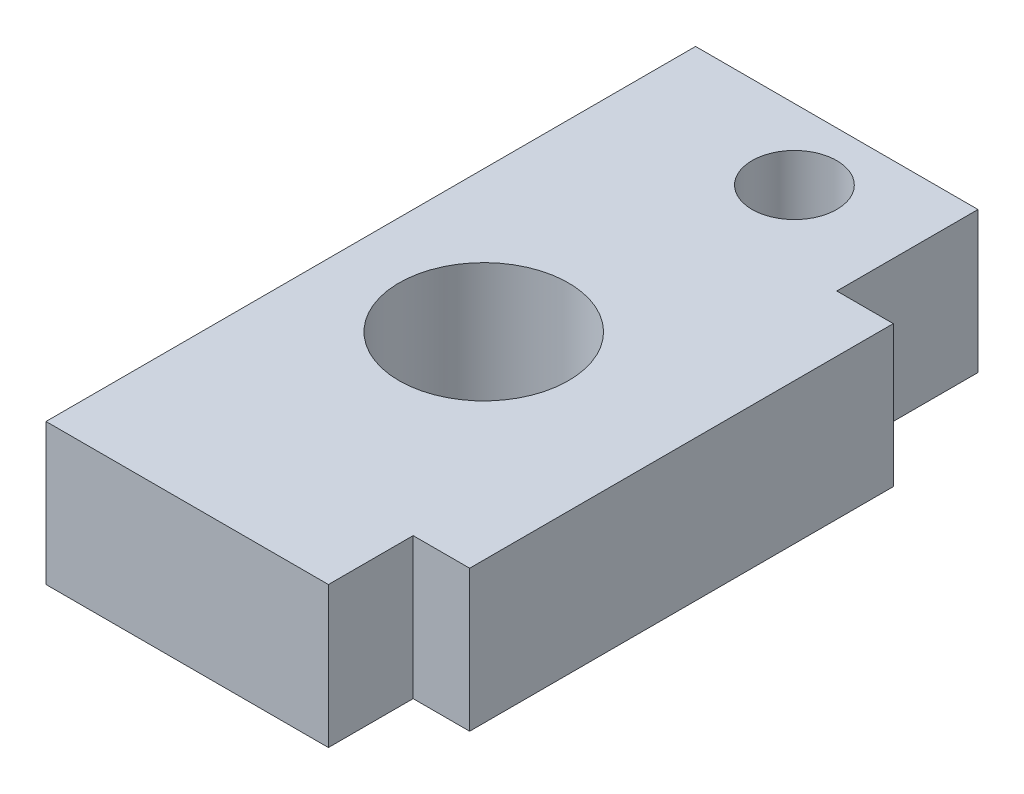
ISO-10303-21;
HEADER;
FILE_DESCRIPTION(('STEP AP214'),'2;1');
FILE_NAME('part.step','',(''),(''),'','','');
FILE_SCHEMA(('AUTOMOTIVE_DESIGN { 1 0 10303 214 1 1 1 1 }'));
ENDSEC;
DATA;
#1=APPLICATION_CONTEXT('core data for automotive mechanical design processes');
#2=APPLICATION_PROTOCOL_DEFINITION('international standard','automotive_design',2000,#1);
#3=PRODUCT_CONTEXT('',#1,'mechanical');
#4=PRODUCT('Part','Part','',(#3));
#5=PRODUCT_RELATED_PRODUCT_CATEGORY('part','',(#4));
#6=PRODUCT_DEFINITION_FORMATION('','',#4);
#7=PRODUCT_DEFINITION_CONTEXT('part definition',#1,'design');
#8=PRODUCT_DEFINITION('design','',#6,#7);
#9=PRODUCT_DEFINITION_SHAPE('','',#8);
#10=(LENGTH_UNIT() NAMED_UNIT(*) SI_UNIT(.MILLI.,.METRE.));
#11=(NAMED_UNIT(*) PLANE_ANGLE_UNIT() SI_UNIT($,.RADIAN.));
#12=(NAMED_UNIT(*) SI_UNIT($,.STERADIAN.) SOLID_ANGLE_UNIT());
#13=UNCERTAINTY_MEASURE_WITH_UNIT(LENGTH_MEASURE(1.E-05),#10,'distance_accuracy_value','');
#14=(GEOMETRIC_REPRESENTATION_CONTEXT(3) GLOBAL_UNCERTAINTY_ASSIGNED_CONTEXT((#13)) GLOBAL_UNIT_ASSIGNED_CONTEXT((#10,
#11,#12)) REPRESENTATION_CONTEXT('',''));
#15=CARTESIAN_POINT('',(0.,0.,0.));
#16=DIRECTION('',(0.,0.,1.));
#17=DIRECTION('',(1.,0.,0.));
#18=AXIS2_PLACEMENT_3D('',#15,#16,#17);
#19=CARTESIAN_POINT('',(-5.,5.,7.5));
#20=DIRECTION('',(0.,0.,-1.));
#21=DIRECTION('',(-1.,0.,0.));
#22=AXIS2_PLACEMENT_3D('',#19,#20,#21);
#23=PLANE('',#22);
#24=DIRECTION('',(0.,1.,0.));
#25=VECTOR('',#24,1.);
#26=CARTESIAN_POINT('',(5.,0.,7.5));
#27=LINE('',#26,#25);
#28=CARTESIAN_POINT('',(5.,0.,7.5));
#29=VERTEX_POINT('',#28);
#30=CARTESIAN_POINT('',(5.,5.,7.5));
#31=VERTEX_POINT('',#30);
#32=EDGE_CURVE('E51',#29,#31,#27,.T.);
#33=ORIENTED_EDGE('',*,*,#32,.F.);
#34=DIRECTION('',(1.,0.,0.));
#35=VECTOR('',#34,1.);
#36=CARTESIAN_POINT('',(-5.,0.,7.5));
#37=LINE('',#36,#35);
#38=CARTESIAN_POINT('',(7.,0.,7.5));
#39=VERTEX_POINT('',#38);
#40=EDGE_CURVE('E154',#29,#39,#37,.T.);
#41=ORIENTED_EDGE('',*,*,#40,.T.);
#42=DIRECTION('',(0.,-1.,0.));
#43=VECTOR('',#42,1.);
#44=CARTESIAN_POINT('',(7.,5.,7.5));
#45=LINE('',#44,#43);
#46=CARTESIAN_POINT('',(7.,5.,7.5));
#47=VERTEX_POINT('',#46);
#48=EDGE_CURVE('E11',#47,#39,#45,.T.);
#49=ORIENTED_EDGE('',*,*,#48,.F.);
#50=DIRECTION('',(1.,0.,0.));
#51=VECTOR('',#50,1.);
#52=CARTESIAN_POINT('',(-5.,5.,7.5));
#53=LINE('',#52,#51);
#54=EDGE_CURVE('E99',#31,#47,#53,.T.);
#55=ORIENTED_EDGE('',*,*,#54,.F.);
#56=EDGE_LOOP('',(#33,#41,#49,#55));
#57=FACE_BOUND('',#56,.T.);
#58=ADVANCED_FACE('F34',(#57),#23,.F.);
#59=CARTESIAN_POINT('',(-5.,5.,-7.5));
#60=DIRECTION('',(1.,0.,0.));
#61=DIRECTION('',(0.,0.,-1.));
#62=AXIS2_PLACEMENT_3D('',#59,#60,#61);
#63=PLANE('',#62);
#64=DIRECTION('',(0.,0.,1.));
#65=VECTOR('',#64,1.);
#66=CARTESIAN_POINT('',(-5.,0.,-7.5));
#67=LINE('',#66,#65);
#68=CARTESIAN_POINT('',(-5.,0.,-12.5));
#69=VERTEX_POINT('',#68);
#70=CARTESIAN_POINT('',(-5.,0.,10.5));
#71=VERTEX_POINT('',#70);
#72=EDGE_CURVE('E157',#69,#71,#67,.T.);
#73=ORIENTED_EDGE('',*,*,#72,.T.);
#74=DIRECTION('',(0.,1.,0.));
#75=VECTOR('',#74,1.);
#76=CARTESIAN_POINT('',(-5.,0.,10.5));
#77=LINE('',#76,#75);
#78=CARTESIAN_POINT('',(-5.,5.,10.5));
#79=VERTEX_POINT('',#78);
#80=EDGE_CURVE('E115',#71,#79,#77,.T.);
#81=ORIENTED_EDGE('',*,*,#80,.T.);
#82=DIRECTION('',(0.,0.,1.));
#83=VECTOR('',#82,1.);
#84=CARTESIAN_POINT('',(-5.,5.,-7.5));
#85=LINE('',#84,#83);
#86=CARTESIAN_POINT('',(-5.,5.,-12.5));
#87=VERTEX_POINT('',#86);
#88=EDGE_CURVE('E104',#87,#79,#85,.T.);
#89=ORIENTED_EDGE('',*,*,#88,.F.);
#90=DIRECTION('',(0.,1.,0.));
#91=VECTOR('',#90,1.);
#92=CARTESIAN_POINT('',(-5.,0.,-12.5));
#93=LINE('',#92,#91);
#94=EDGE_CURVE('E176',#69,#87,#93,.T.);
#95=ORIENTED_EDGE('',*,*,#94,.F.);
#96=EDGE_LOOP('',(#73,#81,#89,#95));
#97=FACE_BOUND('',#96,.T.);
#98=ADVANCED_FACE('F36',(#97),#63,.F.);
#99=CARTESIAN_POINT('',(7.,5.,-7.5));
#100=DIRECTION('',(-1.,0.,0.));
#101=DIRECTION('',(0.,0.,1.));
#102=AXIS2_PLACEMENT_3D('',#99,#100,#101);
#103=PLANE('',#102);
#104=DIRECTION('',(0.,0.,-1.));
#105=VECTOR('',#104,1.);
#106=CARTESIAN_POINT('',(7.,0.,-7.5));
#107=LINE('',#106,#105);
#108=CARTESIAN_POINT('',(7.,0.,-7.5));
#109=VERTEX_POINT('',#108);
#110=EDGE_CURVE('E156',#39,#109,#107,.T.);
#111=ORIENTED_EDGE('',*,*,#110,.T.);
#112=DIRECTION('',(0.,-1.,0.));
#113=VECTOR('',#112,1.);
#114=CARTESIAN_POINT('',(7.,5.,-7.5));
#115=LINE('',#114,#113);
#116=CARTESIAN_POINT('',(7.,5.,-7.5));
#117=VERTEX_POINT('',#116);
#118=EDGE_CURVE('E43',#117,#109,#115,.T.);
#119=ORIENTED_EDGE('',*,*,#118,.F.);
#120=DIRECTION('',(0.,0.,-1.));
#121=VECTOR('',#120,1.);
#122=CARTESIAN_POINT('',(7.,5.,-7.5));
#123=LINE('',#122,#121);
#124=EDGE_CURVE('E103',#47,#117,#123,.T.);
#125=ORIENTED_EDGE('',*,*,#124,.F.);
#126=ORIENTED_EDGE('',*,*,#48,.T.);
#127=EDGE_LOOP('',(#111,#119,#125,#126));
#128=FACE_BOUND('',#127,.T.);
#129=ADVANCED_FACE('F230',(#128),#103,.F.);
#130=CARTESIAN_POINT('',(-5.,5.,-7.5));
#131=DIRECTION('',(0.,0.,1.));
#132=DIRECTION('',(1.,0.,0.));
#133=AXIS2_PLACEMENT_3D('',#130,#131,#132);
#134=PLANE('',#133);
#135=DIRECTION('',(-1.,0.,0.));
#136=VECTOR('',#135,1.);
#137=CARTESIAN_POINT('',(-5.,0.,-7.5));
#138=LINE('',#137,#136);
#139=CARTESIAN_POINT('',(5.,0.,-7.5));
#140=VERTEX_POINT('',#139);
#141=EDGE_CURVE('E164',#109,#140,#138,.T.);
#142=ORIENTED_EDGE('',*,*,#141,.T.);
#143=DIRECTION('',(0.,1.,0.));
#144=VECTOR('',#143,1.);
#145=CARTESIAN_POINT('',(5.,0.,-7.5));
#146=LINE('',#145,#144);
#147=CARTESIAN_POINT('',(5.,5.,-7.5));
#148=VERTEX_POINT('',#147);
#149=EDGE_CURVE('E145',#140,#148,#146,.T.);
#150=ORIENTED_EDGE('',*,*,#149,.T.);
#151=DIRECTION('',(-1.,0.,0.));
#152=VECTOR('',#151,1.);
#153=CARTESIAN_POINT('',(-5.,5.,-7.5));
#154=LINE('',#153,#152);
#155=EDGE_CURVE('E170',#117,#148,#154,.T.);
#156=ORIENTED_EDGE('',*,*,#155,.F.);
#157=ORIENTED_EDGE('',*,*,#118,.T.);
#158=EDGE_LOOP('',(#142,#150,#156,#157));
#159=FACE_BOUND('',#158,.T.);
#160=ADVANCED_FACE('F189',(#159),#134,.F.);
#161=CARTESIAN_POINT('',(0.,5.,0.));
#162=DIRECTION('',(0.,1.,0.));
#163=DIRECTION('',(0.,0.,1.));
#164=AXIS2_PLACEMENT_3D('',#161,#162,#163);
#165=PLANE('',#164);
#166=CARTESIAN_POINT('',(0.,5.,0.));
#167=DIRECTION('',(0.,1.,0.));
#168=DIRECTION('',(0.,0.,1.));
#169=AXIS2_PLACEMENT_3D('',#166,#167,#168);
#170=CIRCLE('',#169,3.);
#171=CARTESIAN_POINT('',(0.,5.,3.));
#172=VERTEX_POINT('',#171);
#173=EDGE_CURVE('E208',#172,#172,#170,.T.);
#174=ORIENTED_EDGE('',*,*,#173,.F.);
#175=EDGE_LOOP('',(#174));
#176=FACE_BOUND('',#175,.T.);
#177=CARTESIAN_POINT('',(1.,5.,-10.));
#178=DIRECTION('',(0.,1.,0.));
#179=DIRECTION('',(0.,0.,1.));
#180=AXIS2_PLACEMENT_3D('',#177,#178,#179);
#181=CIRCLE('',#180,1.5);
#182=CARTESIAN_POINT('',(1.,5.,-8.5));
#183=VERTEX_POINT('',#182);
#184=EDGE_CURVE('E202',#183,#183,#181,.T.);
#185=ORIENTED_EDGE('',*,*,#184,.F.);
#186=EDGE_LOOP('',(#185));
#187=FACE_BOUND('',#186,.T.);
#188=ORIENTED_EDGE('',*,*,#88,.T.);
#189=DIRECTION('',(-1.,0.,0.));
#190=VECTOR('',#189,1.);
#191=CARTESIAN_POINT('',(5.,5.,10.5));
#192=LINE('',#191,#190);
#193=CARTESIAN_POINT('',(5.,5.,10.5));
#194=VERTEX_POINT('',#193);
#195=EDGE_CURVE('E119',#194,#79,#192,.T.);
#196=ORIENTED_EDGE('',*,*,#195,.F.);
#197=DIRECTION('',(0.,0.,1.));
#198=VECTOR('',#197,1.);
#199=CARTESIAN_POINT('',(5.,5.,7.5));
#200=LINE('',#199,#198);
#201=EDGE_CURVE('E111',#31,#194,#200,.T.);
#202=ORIENTED_EDGE('',*,*,#201,.F.);
#203=ORIENTED_EDGE('',*,*,#54,.T.);
#204=ORIENTED_EDGE('',*,*,#124,.T.);
#205=ORIENTED_EDGE('',*,*,#155,.T.);
#206=DIRECTION('',(0.,0.,-1.));
#207=VECTOR('',#206,1.);
#208=CARTESIAN_POINT('',(5.,5.,-7.5));
#209=LINE('',#208,#207);
#210=CARTESIAN_POINT('',(5.,5.,-12.5));
#211=VERTEX_POINT('',#210);
#212=EDGE_CURVE('E59',#148,#211,#209,.T.);
#213=ORIENTED_EDGE('',*,*,#212,.T.);
#214=DIRECTION('',(-1.,0.,0.));
#215=VECTOR('',#214,1.);
#216=CARTESIAN_POINT('',(5.,5.,-12.5));
#217=LINE('',#216,#215);
#218=EDGE_CURVE('E121',#211,#87,#217,.T.);
#219=ORIENTED_EDGE('',*,*,#218,.T.);
#220=EDGE_LOOP('',(#188,#196,#202,#203,#204,#205,#213,#219));
#221=FACE_BOUND('',#220,.T.);
#222=ADVANCED_FACE('F117',(#176,#187,#221),#165,.T.);
#223=CARTESIAN_POINT('',(0.,0.,0.));
#224=DIRECTION('',(0.,1.,0.));
#225=DIRECTION('',(0.,0.,1.));
#226=AXIS2_PLACEMENT_3D('',#223,#224,#225);
#227=PLANE('',#226);
#228=CARTESIAN_POINT('',(0.,0.,0.));
#229=DIRECTION('',(0.,1.,0.));
#230=DIRECTION('',(0.,0.,1.));
#231=AXIS2_PLACEMENT_3D('',#228,#229,#230);
#232=CIRCLE('',#231,3.);
#233=CARTESIAN_POINT('',(0.,0.,3.));
#234=VERTEX_POINT('',#233);
#235=EDGE_CURVE('E38',#234,#234,#232,.T.);
#236=ORIENTED_EDGE('',*,*,#235,.T.);
#237=EDGE_LOOP('',(#236));
#238=FACE_BOUND('',#237,.T.);
#239=CARTESIAN_POINT('',(1.,0.,-10.));
#240=DIRECTION('',(0.,1.,0.));
#241=DIRECTION('',(0.,0.,1.));
#242=AXIS2_PLACEMENT_3D('',#239,#240,#241);
#243=CIRCLE('',#242,1.5);
#244=CARTESIAN_POINT('',(1.,0.,-8.5));
#245=VERTEX_POINT('',#244);
#246=EDGE_CURVE('E199',#245,#245,#243,.T.);
#247=ORIENTED_EDGE('',*,*,#246,.T.);
#248=EDGE_LOOP('',(#247));
#249=FACE_BOUND('',#248,.T.);
#250=ORIENTED_EDGE('',*,*,#72,.F.);
#251=DIRECTION('',(-1.,0.,0.));
#252=VECTOR('',#251,1.);
#253=CARTESIAN_POINT('',(5.,0.,-12.5));
#254=LINE('',#253,#252);
#255=CARTESIAN_POINT('',(5.,0.,-12.5));
#256=VERTEX_POINT('',#255);
#257=EDGE_CURVE('E136',#256,#69,#254,.T.);
#258=ORIENTED_EDGE('',*,*,#257,.F.);
#259=DIRECTION('',(0.,0.,-1.));
#260=VECTOR('',#259,1.);
#261=CARTESIAN_POINT('',(5.,0.,-7.5));
#262=LINE('',#261,#260);
#263=EDGE_CURVE('E138',#140,#256,#262,.T.);
#264=ORIENTED_EDGE('',*,*,#263,.F.);
#265=ORIENTED_EDGE('',*,*,#141,.F.);
#266=ORIENTED_EDGE('',*,*,#110,.F.);
#267=ORIENTED_EDGE('',*,*,#40,.F.);
#268=DIRECTION('',(0.,0.,1.));
#269=VECTOR('',#268,1.);
#270=CARTESIAN_POINT('',(5.,0.,7.5));
#271=LINE('',#270,#269);
#272=CARTESIAN_POINT('',(5.,0.,10.5));
#273=VERTEX_POINT('',#272);
#274=EDGE_CURVE('E113',#29,#273,#271,.T.);
#275=ORIENTED_EDGE('',*,*,#274,.T.);
#276=DIRECTION('',(-1.,0.,0.));
#277=VECTOR('',#276,1.);
#278=CARTESIAN_POINT('',(5.,0.,10.5));
#279=LINE('',#278,#277);
#280=EDGE_CURVE('E114',#273,#71,#279,.T.);
#281=ORIENTED_EDGE('',*,*,#280,.T.);
#282=EDGE_LOOP('',(#250,#258,#264,#265,#266,#267,#275,#281));
#283=FACE_BOUND('',#282,.T.);
#284=ADVANCED_FACE('F191',(#238,#249,#283),#227,.F.);
#285=CARTESIAN_POINT('',(5.,0.,-12.5));
#286=DIRECTION('',(0.,0.,-1.));
#287=DIRECTION('',(-1.,0.,0.));
#288=AXIS2_PLACEMENT_3D('',#285,#286,#287);
#289=PLANE('',#288);
#290=ORIENTED_EDGE('',*,*,#218,.F.);
#291=DIRECTION('',(0.,1.,0.));
#292=VECTOR('',#291,1.);
#293=CARTESIAN_POINT('',(5.,0.,-12.5));
#294=LINE('',#293,#292);
#295=EDGE_CURVE('E142',#256,#211,#294,.T.);
#296=ORIENTED_EDGE('',*,*,#295,.F.);
#297=ORIENTED_EDGE('',*,*,#257,.T.);
#298=ORIENTED_EDGE('',*,*,#94,.T.);
#299=EDGE_LOOP('',(#290,#296,#297,#298));
#300=FACE_BOUND('',#299,.T.);
#301=ADVANCED_FACE('F184',(#300),#289,.T.);
#302=CARTESIAN_POINT('',(5.,0.,-7.5));
#303=DIRECTION('',(1.,0.,0.));
#304=DIRECTION('',(0.,0.,-1.));
#305=AXIS2_PLACEMENT_3D('',#302,#303,#304);
#306=PLANE('',#305);
#307=ORIENTED_EDGE('',*,*,#212,.F.);
#308=ORIENTED_EDGE('',*,*,#149,.F.);
#309=ORIENTED_EDGE('',*,*,#263,.T.);
#310=ORIENTED_EDGE('',*,*,#295,.T.);
#311=EDGE_LOOP('',(#307,#308,#309,#310));
#312=FACE_BOUND('',#311,.T.);
#313=ADVANCED_FACE('F181',(#312),#306,.T.);
#314=CARTESIAN_POINT('',(5.,0.,7.5));
#315=DIRECTION('',(-1.,0.,0.));
#316=DIRECTION('',(0.,0.,1.));
#317=AXIS2_PLACEMENT_3D('',#314,#315,#316);
#318=PLANE('',#317);
#319=ORIENTED_EDGE('',*,*,#201,.T.);
#320=DIRECTION('',(0.,1.,0.));
#321=VECTOR('',#320,1.);
#322=CARTESIAN_POINT('',(5.,0.,10.5));
#323=LINE('',#322,#321);
#324=EDGE_CURVE('E196',#273,#194,#323,.T.);
#325=ORIENTED_EDGE('',*,*,#324,.F.);
#326=ORIENTED_EDGE('',*,*,#274,.F.);
#327=ORIENTED_EDGE('',*,*,#32,.T.);
#328=EDGE_LOOP('',(#319,#325,#326,#327));
#329=FACE_BOUND('',#328,.T.);
#330=ADVANCED_FACE('F109',(#329),#318,.F.);
#331=CARTESIAN_POINT('',(5.,0.,10.5));
#332=DIRECTION('',(0.,0.,-1.));
#333=DIRECTION('',(-1.,0.,0.));
#334=AXIS2_PLACEMENT_3D('',#331,#332,#333);
#335=PLANE('',#334);
#336=ORIENTED_EDGE('',*,*,#195,.T.);
#337=ORIENTED_EDGE('',*,*,#80,.F.);
#338=ORIENTED_EDGE('',*,*,#280,.F.);
#339=ORIENTED_EDGE('',*,*,#324,.T.);
#340=EDGE_LOOP('',(#336,#337,#338,#339));
#341=FACE_BOUND('',#340,.T.);
#342=ADVANCED_FACE('F198',(#341),#335,.F.);
#343=CARTESIAN_POINT('',(1.,0.,-10.));
#344=DIRECTION('',(0.,1.,0.));
#345=DIRECTION('',(0.,0.,1.));
#346=AXIS2_PLACEMENT_3D('',#343,#344,#345);
#347=CYLINDRICAL_SURFACE('',#346,1.5);
#348=ORIENTED_EDGE('',*,*,#246,.F.);
#349=EDGE_LOOP('',(#348));
#350=FACE_BOUND('',#349,.T.);
#351=ORIENTED_EDGE('',*,*,#184,.T.);
#352=EDGE_LOOP('',(#351));
#353=FACE_BOUND('',#352,.T.);
#354=ADVANCED_FACE('F219',(#350,#353),#347,.F.);
#355=CARTESIAN_POINT('',(0.,-5.,0.));
#356=DIRECTION('',(0.,1.,0.));
#357=DIRECTION('',(0.,0.,1.));
#358=AXIS2_PLACEMENT_3D('',#355,#356,#357);
#359=CYLINDRICAL_SURFACE('',#358,3.);
#360=ORIENTED_EDGE('',*,*,#173,.T.);
#361=EDGE_LOOP('',(#360));
#362=FACE_BOUND('',#361,.T.);
#363=ORIENTED_EDGE('',*,*,#235,.F.);
#364=EDGE_LOOP('',(#363));
#365=FACE_BOUND('',#364,.T.);
#366=ADVANCED_FACE('F217',(#362,#365),#359,.F.);
#367=CLOSED_SHELL('',(#58,#98,#129,#160,#222,#284,#301,#313,#330,#342,#354,#366));
#368=MANIFOLD_SOLID_BREP('B2',#367);
#369=ADVANCED_BREP_SHAPE_REPRESENTATION('',(#18,#368),#14);
#370=SHAPE_DEFINITION_REPRESENTATION(#9,#369);
ENDSEC;
END-ISO-10303-21;
